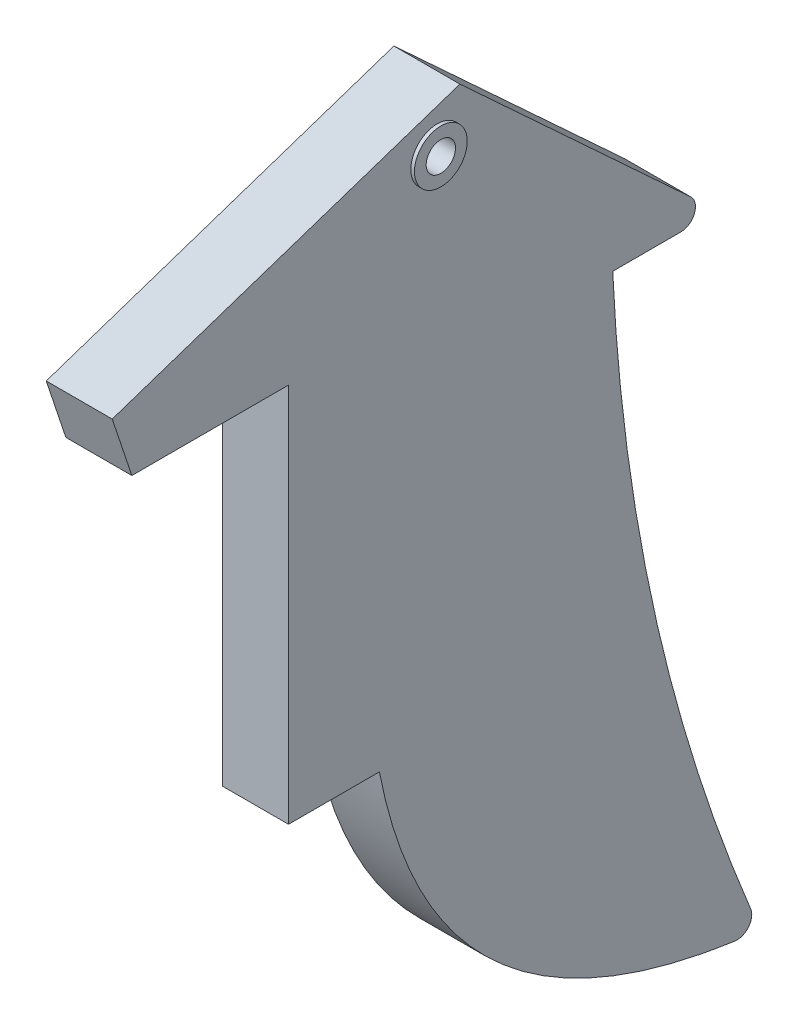
ISO-10303-21;
HEADER;
FILE_DESCRIPTION(('STEP AP214'),'2;1');
FILE_NAME('part.step','',(''),(''),'','','');
FILE_SCHEMA(('AUTOMOTIVE_DESIGN { 1 0 10303 214 1 1 1 1 }'));
ENDSEC;
DATA;
#1=APPLICATION_CONTEXT('core data for automotive mechanical design processes');
#2=APPLICATION_PROTOCOL_DEFINITION('international standard','automotive_design',2000,#1);
#3=PRODUCT_CONTEXT('',#1,'mechanical');
#4=PRODUCT('Part','Part','',(#3));
#5=PRODUCT_RELATED_PRODUCT_CATEGORY('part','',(#4));
#6=PRODUCT_DEFINITION_FORMATION('','',#4);
#7=PRODUCT_DEFINITION_CONTEXT('part definition',#1,'design');
#8=PRODUCT_DEFINITION('design','',#6,#7);
#9=PRODUCT_DEFINITION_SHAPE('','',#8);
#10=(LENGTH_UNIT() NAMED_UNIT(*) SI_UNIT(.MILLI.,.METRE.));
#11=(NAMED_UNIT(*) PLANE_ANGLE_UNIT() SI_UNIT($,.RADIAN.));
#12=(NAMED_UNIT(*) SI_UNIT($,.STERADIAN.) SOLID_ANGLE_UNIT());
#13=UNCERTAINTY_MEASURE_WITH_UNIT(LENGTH_MEASURE(1.E-05),#10,'distance_accuracy_value','');
#14=(GEOMETRIC_REPRESENTATION_CONTEXT(3) GLOBAL_UNCERTAINTY_ASSIGNED_CONTEXT((#13)) GLOBAL_UNIT_ASSIGNED_CONTEXT((#10,
#11,#12)) REPRESENTATION_CONTEXT('',''));
#15=CARTESIAN_POINT('',(0.,0.,0.));
#16=DIRECTION('',(0.,0.,1.));
#17=DIRECTION('',(1.,0.,0.));
#18=AXIS2_PLACEMENT_3D('',#15,#16,#17);
#19=CARTESIAN_POINT('',(4.5,-16.2675550550536,-17.6253256744449));
#20=DIRECTION('',(0.,-0.734844510898224,0.678235611570751));
#21=DIRECTION('',(0.,-0.678235611570751,-0.734844510898224));
#22=AXIS2_PLACEMENT_3D('',#19,#20,#21);
#23=PLANE('',#22);
#24=DIRECTION('',(0.,0.678235611570751,0.734844510898224));
#25=VECTOR('',#24,1.);
#26=CARTESIAN_POINT('',(4.5,-16.2675550550536,-17.6253256744449));
#27=LINE('',#26,#25);
#28=CARTESIAN_POINT('',(4.5,-14.5327105441554,-15.7456824585085));
#29=VERTEX_POINT('',#28);
#30=CARTESIAN_POINT('',(4.5,0.,0.));
#31=VERTEX_POINT('',#30);
#32=EDGE_CURVE('E124',#29,#31,#27,.T.);
#33=ORIENTED_EDGE('',*,*,#32,.F.);
#34=DIRECTION('',(-1.,0.,0.));
#35=VECTOR('',#34,1.);
#36=CARTESIAN_POINT('',(4.5,-14.5327105441554,-15.7456824585085));
#37=LINE('',#36,#35);
#38=CARTESIAN_POINT('',(0.,-14.5327105441554,-15.7456824585085));
#39=VERTEX_POINT('',#38);
#40=EDGE_CURVE('E153',#29,#39,#37,.T.);
#41=ORIENTED_EDGE('',*,*,#40,.T.);
#42=DIRECTION('',(0.,0.678235611570751,0.734844510898224));
#43=VECTOR('',#42,1.);
#44=CARTESIAN_POINT('',(0.,-16.2675550550536,-17.6253256744449));
#45=LINE('',#44,#43);
#46=CARTESIAN_POINT('',(0.,0.,0.));
#47=VERTEX_POINT('',#46);
#48=EDGE_CURVE('E150',#39,#47,#45,.T.);
#49=ORIENTED_EDGE('',*,*,#48,.T.);
#50=DIRECTION('',(-1.,0.,0.));
#51=VECTOR('',#50,1.);
#52=CARTESIAN_POINT('',(4.5,0.,0.));
#53=LINE('',#52,#51);
#54=EDGE_CURVE('E142',#31,#47,#53,.T.);
#55=ORIENTED_EDGE('',*,*,#54,.F.);
#56=EDGE_LOOP('',(#33,#41,#49,#55));
#57=FACE_BOUND('',#56,.T.);
#58=ADVANCED_FACE('F39',(#57),#23,.F.);
#59=CARTESIAN_POINT('',(4.5,0.,0.));
#60=DIRECTION('',(0.,-0.948393289115171,-0.317096466649042));
#61=DIRECTION('',(0.,0.317096466649042,-0.948393289115171));
#62=AXIS2_PLACEMENT_3D('',#59,#60,#61);
#63=PLANE('',#62);
#64=DIRECTION('',(0.,-0.317096466649042,0.948393289115171));
#65=VECTOR('',#64,1.);
#66=CARTESIAN_POINT('',(0.,0.,0.));
#67=LINE('',#66,#65);
#68=CARTESIAN_POINT('',(0.,-7.92741166622604,23.7098322278793));
#69=VERTEX_POINT('',#68);
#70=EDGE_CURVE('E222',#47,#69,#67,.T.);
#71=ORIENTED_EDGE('',*,*,#70,.T.);
#72=DIRECTION('',(-1.,0.,0.));
#73=VECTOR('',#72,1.);
#74=CARTESIAN_POINT('',(4.5,-7.92741166622604,23.7098322278793));
#75=LINE('',#74,#73);
#76=CARTESIAN_POINT('',(4.5,-7.92741166622604,23.7098322278793));
#77=VERTEX_POINT('',#76);
#78=EDGE_CURVE('E144',#77,#69,#75,.T.);
#79=ORIENTED_EDGE('',*,*,#78,.F.);
#80=DIRECTION('',(0.,-0.317096466649042,0.948393289115171));
#81=VECTOR('',#80,1.);
#82=CARTESIAN_POINT('',(4.5,0.,0.));
#83=LINE('',#82,#81);
#84=EDGE_CURVE('E127',#31,#77,#83,.T.);
#85=ORIENTED_EDGE('',*,*,#84,.F.);
#86=ORIENTED_EDGE('',*,*,#54,.T.);
#87=EDGE_LOOP('',(#71,#79,#85,#86));
#88=FACE_BOUND('',#87,.T.);
#89=ADVANCED_FACE('F141',(#88),#63,.F.);
#90=CARTESIAN_POINT('',(4.5,-7.92741166622604,23.7098322278793));
#91=DIRECTION('',(0.,0.317096466649042,-0.948393289115171));
#92=DIRECTION('',(0.,0.948393289115171,0.317096466649042));
#93=AXIS2_PLACEMENT_3D('',#90,#91,#92);
#94=PLANE('',#93);
#95=DIRECTION('',(0.,-0.948393289115171,-0.317096466649042));
#96=VECTOR('',#95,1.);
#97=CARTESIAN_POINT('',(0.,-7.92741166622604,23.7098322278793));
#98=LINE('',#97,#96);
#99=CARTESIAN_POINT('',(0.,-11.9323938104307,22.3707615053263));
#100=VERTEX_POINT('',#99);
#101=EDGE_CURVE('E228',#69,#100,#98,.T.);
#102=ORIENTED_EDGE('',*,*,#101,.T.);
#103=DIRECTION('',(-1.,0.,0.));
#104=VECTOR('',#103,1.);
#105=CARTESIAN_POINT('',(4.5,-11.9323938104307,22.3707615053263));
#106=LINE('',#105,#104);
#107=CARTESIAN_POINT('',(4.5,-11.9323938104307,22.3707615053263));
#108=VERTEX_POINT('',#107);
#109=EDGE_CURVE('E159',#108,#100,#106,.T.);
#110=ORIENTED_EDGE('',*,*,#109,.F.);
#111=DIRECTION('',(0.,-0.948393289115171,-0.317096466649042));
#112=VECTOR('',#111,1.);
#113=CARTESIAN_POINT('',(4.5,-7.92741166622604,23.7098322278793));
#114=LINE('',#113,#112);
#115=EDGE_CURVE('E147',#77,#108,#114,.T.);
#116=ORIENTED_EDGE('',*,*,#115,.F.);
#117=ORIENTED_EDGE('',*,*,#78,.T.);
#118=EDGE_LOOP('',(#102,#110,#116,#117));
#119=FACE_BOUND('',#118,.T.);
#120=ADVANCED_FACE('F206',(#119),#94,.F.);
#121=CARTESIAN_POINT('',(4.5,-11.9323938104307,22.3707615053263));
#122=DIRECTION('',(0.,1.,0.));
#123=DIRECTION('',(0.,0.,1.));
#124=AXIS2_PLACEMENT_3D('',#121,#122,#123);
#125=PLANE('',#124);
#126=DIRECTION('',(0.,0.,-1.));
#127=VECTOR('',#126,1.);
#128=CARTESIAN_POINT('',(0.,-11.9323938104307,22.3707615053263));
#129=LINE('',#128,#127);
#130=CARTESIAN_POINT('',(0.,-11.9323938104307,11.6857718529667));
#131=VERTEX_POINT('',#130);
#132=EDGE_CURVE('E239',#100,#131,#129,.T.);
#133=ORIENTED_EDGE('',*,*,#132,.T.);
#134=DIRECTION('',(-1.,0.,0.));
#135=VECTOR('',#134,1.);
#136=CARTESIAN_POINT('',(4.5,-11.9323938104307,11.6857718529667));
#137=LINE('',#136,#135);
#138=CARTESIAN_POINT('',(4.5,-11.9323938104307,11.6857718529667));
#139=VERTEX_POINT('',#138);
#140=EDGE_CURVE('E278',#139,#131,#137,.T.);
#141=ORIENTED_EDGE('',*,*,#140,.F.);
#142=DIRECTION('',(0.,0.,-1.));
#143=VECTOR('',#142,1.);
#144=CARTESIAN_POINT('',(4.5,-11.9323938104307,22.3707615053263));
#145=LINE('',#144,#143);
#146=EDGE_CURVE('E289',#108,#139,#145,.T.);
#147=ORIENTED_EDGE('',*,*,#146,.F.);
#148=ORIENTED_EDGE('',*,*,#109,.T.);
#149=EDGE_LOOP('',(#133,#141,#147,#148));
#150=FACE_BOUND('',#149,.T.);
#151=ADVANCED_FACE('F287',(#150),#125,.F.);
#152=CARTESIAN_POINT('',(4.5,-11.9323938104307,11.6857718529667));
#153=DIRECTION('',(0.,0.,-1.));
#154=DIRECTION('',(0.,1.,0.));
#155=AXIS2_PLACEMENT_3D('',#152,#153,#154);
#156=PLANE('',#155);
#157=DIRECTION('',(0.,-1.,0.));
#158=VECTOR('',#157,1.);
#159=CARTESIAN_POINT('',(0.,-11.9323938104307,11.6857718529667));
#160=LINE('',#159,#158);
#161=CARTESIAN_POINT('',(0.,-37.8740212324027,11.6857718529667));
#162=VERTEX_POINT('',#161);
#163=EDGE_CURVE('E242',#131,#162,#160,.T.);
#164=ORIENTED_EDGE('',*,*,#163,.T.);
#165=DIRECTION('',(-1.,0.,0.));
#166=VECTOR('',#165,1.);
#167=CARTESIAN_POINT('',(4.5,-37.8740212324027,11.6857718529667));
#168=LINE('',#167,#166);
#169=CARTESIAN_POINT('',(4.5,-37.8740212324027,11.6857718529667));
#170=VERTEX_POINT('',#169);
#171=EDGE_CURVE('E274',#170,#162,#168,.T.);
#172=ORIENTED_EDGE('',*,*,#171,.F.);
#173=DIRECTION('',(0.,-1.,0.));
#174=VECTOR('',#173,1.);
#175=CARTESIAN_POINT('',(4.5,-11.9323938104307,11.6857718529667));
#176=LINE('',#175,#174);
#177=EDGE_CURVE('E304',#139,#170,#176,.T.);
#178=ORIENTED_EDGE('',*,*,#177,.F.);
#179=ORIENTED_EDGE('',*,*,#140,.T.);
#180=EDGE_LOOP('',(#164,#172,#178,#179));
#181=FACE_BOUND('',#180,.T.);
#182=ADVANCED_FACE('F295',(#181),#156,.F.);
#183=CARTESIAN_POINT('',(4.5,-37.8740212324027,11.6857718529667));
#184=DIRECTION('',(0.,1.,0.));
#185=DIRECTION('',(0.,0.,1.));
#186=AXIS2_PLACEMENT_3D('',#183,#184,#185);
#187=PLANE('',#186);
#188=DIRECTION('',(0.,0.,-1.));
#189=VECTOR('',#188,1.);
#190=CARTESIAN_POINT('',(0.,-37.8740212324027,11.6857718529667));
#191=LINE('',#190,#189);
#192=CARTESIAN_POINT('',(0.,-37.8740212324027,5.48856837574249));
#193=VERTEX_POINT('',#192);
#194=EDGE_CURVE('E245',#162,#193,#191,.T.);
#195=ORIENTED_EDGE('',*,*,#194,.T.);
#196=DIRECTION('',(-1.,0.,0.));
#197=VECTOR('',#196,1.);
#198=CARTESIAN_POINT('',(4.5,-37.8740212324027,5.48856837574249));
#199=LINE('',#198,#197);
#200=CARTESIAN_POINT('',(4.5,-37.8740212324027,5.48856837574249));
#201=VERTEX_POINT('',#200);
#202=EDGE_CURVE('E270',#201,#193,#199,.T.);
#203=ORIENTED_EDGE('',*,*,#202,.F.);
#204=DIRECTION('',(0.,0.,-1.));
#205=VECTOR('',#204,1.);
#206=CARTESIAN_POINT('',(4.5,-37.8740212324027,11.6857718529667));
#207=LINE('',#206,#205);
#208=EDGE_CURVE('E301',#170,#201,#207,.T.);
#209=ORIENTED_EDGE('',*,*,#208,.F.);
#210=ORIENTED_EDGE('',*,*,#171,.T.);
#211=EDGE_LOOP('',(#195,#203,#209,#210));
#212=FACE_BOUND('',#211,.T.);
#213=ADVANCED_FACE('F299',(#212),#187,.F.);
#214=CARTESIAN_POINT('',(4.5,-37.8740212324027,5.48856837574249));
#215=CARTESIAN_POINT('',(4.5,-57.8903160761035,1.64322261415932));
#216=CARTESIAN_POINT('',(4.5,-60.1993385356175,-20.4966096148225));
#217=B_SPLINE_CURVE_WITH_KNOTS('',2,(#214,#215,#216),.UNSPECIFIED.,.F.,.F.,(3,3),(0.,1.),.UNSPECIFIED.);
#218=DIRECTION('',(-1.,0.,0.));
#219=VECTOR('',#218,1.);
#220=SURFACE_OF_LINEAR_EXTRUSION('',#217,#219);
#221=CARTESIAN_POINT('',(0.,-37.8740212324027,5.48856837574249));
#222=CARTESIAN_POINT('',(0.,-57.8903160761035,1.64322261415932));
#223=CARTESIAN_POINT('',(0.,-60.1993385356175,-20.4966096148225));
#224=B_SPLINE_CURVE_WITH_KNOTS('',2,(#221,#222,#223),.UNSPECIFIED.,.F.,.F.,(3,3),(0.,1.),.UNSPECIFIED.);
#225=CARTESIAN_POINT('',(0.,-59.9878369841446,-18.7657144543999));
#226=VERTEX_POINT('',#225);
#227=EDGE_CURVE('E248',#193,#226,#224,.T.);
#228=ORIENTED_EDGE('',*,*,#227,.T.);
#229=DIRECTION('',(-1.,0.,0.));
#230=VECTOR('',#229,1.);
#231=CARTESIAN_POINT('',(0.,-59.9878369841446,-18.7657144543999));
#232=LINE('',#231,#230);
#233=CARTESIAN_POINT('',(4.5,-59.9878369841446,-18.7657144543999));
#234=VERTEX_POINT('',#233);
#235=EDGE_CURVE('E55',#226,#234,#232,.F.);
#236=ORIENTED_EDGE('',*,*,#235,.T.);
#237=EDGE_CURVE('E303',#201,#234,#217,.T.);
#238=ORIENTED_EDGE('',*,*,#237,.F.);
#239=ORIENTED_EDGE('',*,*,#202,.T.);
#240=EDGE_LOOP('',(#228,#236,#238,#239));
#241=FACE_BOUND('',#240,.T.);
#242=ADVANCED_FACE('F322',(#241),#220,.F.);
#243=CARTESIAN_POINT('',(4.5,-60.1993385356175,-20.4966096148225));
#244=CARTESIAN_POINT('',(4.5,-39.1969515228556,-11.4809645237938));
#245=CARTESIAN_POINT('',(4.5,-16.2675550550536,-10.4231702819952));
#246=B_SPLINE_CURVE_WITH_KNOTS('',2,(#243,#244,#245),.UNSPECIFIED.,.F.,.F.,(3,3),(0.,1.),.UNSPECIFIED.);
#247=DIRECTION('',(-1.,0.,0.));
#248=VECTOR('',#247,1.);
#249=SURFACE_OF_LINEAR_EXTRUSION('',#246,#248);
#250=CARTESIAN_POINT('',(4.5,-58.6154099664554,-19.8291289112356));
#251=VERTEX_POINT('',#250);
#252=CARTESIAN_POINT('',(4.5,-16.2675550550536,-10.4231702819952));
#253=VERTEX_POINT('',#252);
#254=EDGE_CURVE('E308',#251,#253,#246,.T.);
#255=ORIENTED_EDGE('',*,*,#254,.F.);
#256=DIRECTION('',(-1.,0.,0.));
#257=VECTOR('',#256,1.);
#258=CARTESIAN_POINT('',(4.5,-58.6154099664554,-19.8291289112356));
#259=LINE('',#258,#257);
#260=CARTESIAN_POINT('',(0.,-58.6154099664554,-19.8291289112356));
#261=VERTEX_POINT('',#260);
#262=EDGE_CURVE('E170',#251,#261,#259,.T.);
#263=ORIENTED_EDGE('',*,*,#262,.T.);
#264=CARTESIAN_POINT('',(0.,-60.1993385356175,-20.4966096148225));
#265=CARTESIAN_POINT('',(0.,-39.1969515228556,-11.4809645237938));
#266=CARTESIAN_POINT('',(0.,-16.2675550550536,-10.4231702819952));
#267=B_SPLINE_CURVE_WITH_KNOTS('',2,(#264,#265,#266),.UNSPECIFIED.,.F.,.F.,(3,3),(0.,1.),.UNSPECIFIED.);
#268=CARTESIAN_POINT('',(0.,-16.2675550550536,-10.4231702819952));
#269=VERTEX_POINT('',#268);
#270=EDGE_CURVE('E253',#261,#269,#267,.T.);
#271=ORIENTED_EDGE('',*,*,#270,.T.);
#272=DIRECTION('',(-1.,0.,0.));
#273=VECTOR('',#272,1.);
#274=CARTESIAN_POINT('',(4.5,-16.2675550550536,-10.4231702819952));
#275=LINE('',#274,#273);
#276=EDGE_CURVE('E266',#253,#269,#275,.T.);
#277=ORIENTED_EDGE('',*,*,#276,.F.);
#278=EDGE_LOOP('',(#255,#263,#271,#277));
#279=FACE_BOUND('',#278,.T.);
#280=ADVANCED_FACE('F197',(#279),#249,.F.);
#281=CARTESIAN_POINT('',(4.5,-16.2675550550536,-10.4231702819952));
#282=DIRECTION('',(0.,1.,0.));
#283=DIRECTION('',(0.,0.,1.));
#284=AXIS2_PLACEMENT_3D('',#281,#282,#283);
#285=PLANE('',#284);
#286=DIRECTION('',(0.,0.,-1.));
#287=VECTOR('',#286,1.);
#288=CARTESIAN_POINT('',(0.,-16.2675550550536,-10.4231702819952));
#289=LINE('',#288,#287);
#290=CARTESIAN_POINT('',(0.,-16.2675550550536,-15.0674468469377));
#291=VERTEX_POINT('',#290);
#292=EDGE_CURVE('E137',#269,#291,#289,.T.);
#293=ORIENTED_EDGE('',*,*,#292,.T.);
#294=DIRECTION('',(-1.,0.,0.));
#295=VECTOR('',#294,1.);
#296=CARTESIAN_POINT('',(4.5,-16.2675550550536,-15.0674468469377));
#297=LINE('',#296,#295);
#298=CARTESIAN_POINT('',(4.5,-16.2675550550536,-15.0674468469377));
#299=VERTEX_POINT('',#298);
#300=EDGE_CURVE('E165',#291,#299,#297,.F.);
#301=ORIENTED_EDGE('',*,*,#300,.T.);
#302=DIRECTION('',(0.,0.,-1.));
#303=VECTOR('',#302,1.);
#304=CARTESIAN_POINT('',(4.5,-16.2675550550536,-10.4231702819952));
#305=LINE('',#304,#303);
#306=EDGE_CURVE('E234',#253,#299,#305,.T.);
#307=ORIENTED_EDGE('',*,*,#306,.F.);
#308=ORIENTED_EDGE('',*,*,#276,.T.);
#309=EDGE_LOOP('',(#293,#301,#307,#308));
#310=FACE_BOUND('',#309,.T.);
#311=ADVANCED_FACE('F188',(#310),#285,.F.);
#312=CARTESIAN_POINT('',(4.5,-53.4634979800568,-2.93039900269033));
#313=DIRECTION('',(-1.,0.,0.));
#314=DIRECTION('',(0.,0.,1.));
#315=AXIS2_PLACEMENT_3D('',#312,#313,#314);
#316=PLANE('',#315);
#317=CARTESIAN_POINT('',(4.5,-3.37223552666983,1.54925256068286));
#318=DIRECTION('',(-1.,0.,0.));
#319=DIRECTION('',(0.,0.,1.));
#320=AXIS2_PLACEMENT_3D('',#317,#318,#319);
#321=CIRCLE('',#320,1.8);
#322=CARTESIAN_POINT('',(4.5,-3.37223552666983,3.34925256068286));
#323=VERTEX_POINT('',#322);
#324=EDGE_CURVE('E48',#323,#323,#321,.F.);
#325=ORIENTED_EDGE('',*,*,#324,.F.);
#326=EDGE_LOOP('',(#325));
#327=FACE_BOUND('',#326,.T.);
#328=ORIENTED_EDGE('',*,*,#237,.T.);
#329=CARTESIAN_POINT('',(4.5,-58.9975905269062,-18.9050412426599));
#330=DIRECTION('',(-1.,0.,0.));
#331=DIRECTION('',(0.,0.,1.));
#332=AXIS2_PLACEMENT_3D('',#329,#330,#331);
#333=CIRCLE('',#332,1.);
#334=EDGE_CURVE('E178',#234,#251,#333,.F.);
#335=ORIENTED_EDGE('',*,*,#334,.T.);
#336=ORIENTED_EDGE('',*,*,#254,.T.);
#337=ORIENTED_EDGE('',*,*,#306,.T.);
#338=CARTESIAN_POINT('',(4.5,-15.2675550550536,-15.0674468469377));
#339=DIRECTION('',(-1.,0.,0.));
#340=DIRECTION('',(0.,0.,1.));
#341=AXIS2_PLACEMENT_3D('',#338,#339,#340);
#342=CIRCLE('',#341,1.);
#343=EDGE_CURVE('E131',#299,#29,#342,.F.);
#344=ORIENTED_EDGE('',*,*,#343,.T.);
#345=ORIENTED_EDGE('',*,*,#32,.T.);
#346=ORIENTED_EDGE('',*,*,#84,.T.);
#347=ORIENTED_EDGE('',*,*,#115,.T.);
#348=ORIENTED_EDGE('',*,*,#146,.T.);
#349=ORIENTED_EDGE('',*,*,#177,.T.);
#350=ORIENTED_EDGE('',*,*,#208,.T.);
#351=EDGE_LOOP('',(#328,#335,#336,#337,#344,#345,#346,#347,#348,#349,#350));
#352=FACE_BOUND('',#351,.T.);
#353=ADVANCED_FACE('F126',(#327,#352),#316,.F.);
#354=CARTESIAN_POINT('',(0.,-53.4634979800568,-2.93039900269033));
#355=DIRECTION('',(-1.,0.,0.));
#356=DIRECTION('',(0.,0.,1.));
#357=AXIS2_PLACEMENT_3D('',#354,#355,#356);
#358=PLANE('',#357);
#359=CARTESIAN_POINT('',(0.,-3.37223552666983,1.54925256068286));
#360=DIRECTION('',(-1.,0.,0.));
#361=DIRECTION('',(0.,0.,1.));
#362=AXIS2_PLACEMENT_3D('',#359,#360,#361);
#363=CIRCLE('',#362,1.8);
#364=CARTESIAN_POINT('',(0.,-3.37223552666983,3.34925256068286));
#365=VERTEX_POINT('',#364);
#366=EDGE_CURVE('E11',#365,#365,#363,.T.);
#367=ORIENTED_EDGE('',*,*,#366,.F.);
#368=EDGE_LOOP('',(#367));
#369=FACE_BOUND('',#368,.T.);
#370=ORIENTED_EDGE('',*,*,#270,.F.);
#371=CARTESIAN_POINT('',(0.,-58.9975905269062,-18.9050412426599));
#372=DIRECTION('',(-1.,0.,0.));
#373=DIRECTION('',(0.,0.,1.));
#374=AXIS2_PLACEMENT_3D('',#371,#372,#373);
#375=CIRCLE('',#374,1.);
#376=EDGE_CURVE('E63',#261,#226,#375,.T.);
#377=ORIENTED_EDGE('',*,*,#376,.T.);
#378=ORIENTED_EDGE('',*,*,#227,.F.);
#379=ORIENTED_EDGE('',*,*,#194,.F.);
#380=ORIENTED_EDGE('',*,*,#163,.F.);
#381=ORIENTED_EDGE('',*,*,#132,.F.);
#382=ORIENTED_EDGE('',*,*,#101,.F.);
#383=ORIENTED_EDGE('',*,*,#70,.F.);
#384=ORIENTED_EDGE('',*,*,#48,.F.);
#385=CARTESIAN_POINT('',(0.,-15.2675550550536,-15.0674468469377));
#386=DIRECTION('',(-1.,0.,0.));
#387=DIRECTION('',(0.,0.,1.));
#388=AXIS2_PLACEMENT_3D('',#385,#386,#387);
#389=CIRCLE('',#388,1.);
#390=EDGE_CURVE('E157',#39,#291,#389,.T.);
#391=ORIENTED_EDGE('',*,*,#390,.T.);
#392=ORIENTED_EDGE('',*,*,#292,.F.);
#393=EDGE_LOOP('',(#370,#377,#378,#379,#380,#381,#382,#383,#384,#391,#392));
#394=FACE_BOUND('',#393,.T.);
#395=ADVANCED_FACE('F187',(#369,#394),#358,.T.);
#396=CARTESIAN_POINT('',(0.,-3.37223552666983,1.54925256068286));
#397=DIRECTION('',(1.,0.,0.));
#398=DIRECTION('',(0.,0.,-1.));
#399=AXIS2_PLACEMENT_3D('',#396,#397,#398);
#400=CYLINDRICAL_SURFACE('',#399,1.);
#401=CARTESIAN_POINT('',(4.75,-3.37223552666983,1.54925256068286));
#402=DIRECTION('',(1.,0.,0.));
#403=DIRECTION('',(0.,0.,-1.));
#404=AXIS2_PLACEMENT_3D('',#401,#402,#403);
#405=CIRCLE('',#404,1.);
#406=CARTESIAN_POINT('',(4.75,-3.37223552666983,0.549252560682862));
#407=VERTEX_POINT('',#406);
#408=EDGE_CURVE('E231',#407,#407,#405,.T.);
#409=ORIENTED_EDGE('',*,*,#408,.T.);
#410=EDGE_LOOP('',(#409));
#411=FACE_BOUND('',#410,.T.);
#412=CARTESIAN_POINT('',(-0.25,-3.37223552666983,1.54925256068286));
#413=DIRECTION('',(1.,0.,0.));
#414=DIRECTION('',(0.,0.,-1.));
#415=AXIS2_PLACEMENT_3D('',#412,#413,#414);
#416=CIRCLE('',#415,1.);
#417=CARTESIAN_POINT('',(-0.25,-3.37223552666983,0.549252560682862));
#418=VERTEX_POINT('',#417);
#419=EDGE_CURVE('E345',#418,#418,#416,.T.);
#420=ORIENTED_EDGE('',*,*,#419,.F.);
#421=EDGE_LOOP('',(#420));
#422=FACE_BOUND('',#421,.T.);
#423=ADVANCED_FACE('F194',(#411,#422),#400,.F.);
#424=CARTESIAN_POINT('',(4.5,-15.2675550550536,-15.0674468469377));
#425=DIRECTION('',(-1.,0.,0.));
#426=DIRECTION('',(0.,0.,1.));
#427=AXIS2_PLACEMENT_3D('',#424,#425,#426);
#428=CYLINDRICAL_SURFACE('',#427,1.);
#429=ORIENTED_EDGE('',*,*,#343,.F.);
#430=ORIENTED_EDGE('',*,*,#300,.F.);
#431=ORIENTED_EDGE('',*,*,#390,.F.);
#432=ORIENTED_EDGE('',*,*,#40,.F.);
#433=EDGE_LOOP('',(#429,#430,#431,#432));
#434=FACE_BOUND('',#433,.T.);
#435=ADVANCED_FACE('F209',(#434),#428,.T.);
#436=CARTESIAN_POINT('',(2.25,-58.9975905269062,-18.9050412426599));
#437=DIRECTION('',(-1.,0.,0.));
#438=DIRECTION('',(0.,0.,1.));
#439=AXIS2_PLACEMENT_3D('',#436,#437,#438);
#440=CYLINDRICAL_SURFACE('',#439,1.);
#441=ORIENTED_EDGE('',*,*,#334,.F.);
#442=ORIENTED_EDGE('',*,*,#235,.F.);
#443=ORIENTED_EDGE('',*,*,#376,.F.);
#444=ORIENTED_EDGE('',*,*,#262,.F.);
#445=EDGE_LOOP('',(#441,#442,#443,#444));
#446=FACE_BOUND('',#445,.T.);
#447=ADVANCED_FACE('F41',(#446),#440,.T.);
#448=CARTESIAN_POINT('',(4.75,-3.37223552666983,1.54925256068286));
#449=DIRECTION('',(-1.,0.,0.));
#450=DIRECTION('',(0.,0.,1.));
#451=AXIS2_PLACEMENT_3D('',#448,#449,#450);
#452=CYLINDRICAL_SURFACE('',#451,1.8);
#453=CARTESIAN_POINT('',(4.75,-3.37223552666983,1.54925256068286));
#454=DIRECTION('',(1.,0.,0.));
#455=DIRECTION('',(0.,0.,-1.));
#456=AXIS2_PLACEMENT_3D('',#453,#454,#455);
#457=CIRCLE('',#456,1.8);
#458=CARTESIAN_POINT('',(4.75,-3.37223552666983,-0.250747439317138));
#459=VERTEX_POINT('',#458);
#460=EDGE_CURVE('E224',#459,#459,#457,.T.);
#461=ORIENTED_EDGE('',*,*,#460,.F.);
#462=EDGE_LOOP('',(#461));
#463=FACE_BOUND('',#462,.T.);
#464=ORIENTED_EDGE('',*,*,#324,.T.);
#465=EDGE_LOOP('',(#464));
#466=FACE_BOUND('',#465,.T.);
#467=ADVANCED_FACE('F184',(#463,#466),#452,.T.);
#468=CARTESIAN_POINT('',(4.75,-3.37223552666983,1.54925256068286));
#469=DIRECTION('',(1.,0.,0.));
#470=DIRECTION('',(0.,0.,-1.));
#471=AXIS2_PLACEMENT_3D('',#468,#469,#470);
#472=PLANE('',#471);
#473=ORIENTED_EDGE('',*,*,#408,.F.);
#474=EDGE_LOOP('',(#473));
#475=FACE_BOUND('',#474,.T.);
#476=ORIENTED_EDGE('',*,*,#460,.T.);
#477=EDGE_LOOP('',(#476));
#478=FACE_BOUND('',#477,.T.);
#479=ADVANCED_FACE('F360',(#475,#478),#472,.T.);
#480=CARTESIAN_POINT('',(-0.25,-3.37223552666983,1.54925256068286));
#481=DIRECTION('',(1.,0.,0.));
#482=DIRECTION('',(0.,0.,-1.));
#483=AXIS2_PLACEMENT_3D('',#480,#481,#482);
#484=CYLINDRICAL_SURFACE('',#483,1.8);
#485=CARTESIAN_POINT('',(-0.25,-3.37223552666983,1.54925256068286));
#486=DIRECTION('',(1.,0.,0.));
#487=DIRECTION('',(0.,0.,-1.));
#488=AXIS2_PLACEMENT_3D('',#485,#486,#487);
#489=CIRCLE('',#488,1.8);
#490=CARTESIAN_POINT('',(-0.25,-3.37223552666983,-0.250747439317138));
#491=VERTEX_POINT('',#490);
#492=EDGE_CURVE('E341',#491,#491,#489,.T.);
#493=ORIENTED_EDGE('',*,*,#492,.T.);
#494=EDGE_LOOP('',(#493));
#495=FACE_BOUND('',#494,.T.);
#496=ORIENTED_EDGE('',*,*,#366,.T.);
#497=EDGE_LOOP('',(#496));
#498=FACE_BOUND('',#497,.T.);
#499=ADVANCED_FACE('F354',(#495,#498),#484,.T.);
#500=CARTESIAN_POINT('',(-0.25,-3.37223552666983,1.54925256068286));
#501=DIRECTION('',(-1.,0.,0.));
#502=DIRECTION('',(0.,0.,-1.));
#503=AXIS2_PLACEMENT_3D('',#500,#501,#502);
#504=PLANE('',#503);
#505=ORIENTED_EDGE('',*,*,#419,.T.);
#506=EDGE_LOOP('',(#505));
#507=FACE_BOUND('',#506,.T.);
#508=ORIENTED_EDGE('',*,*,#492,.F.);
#509=EDGE_LOOP('',(#508));
#510=FACE_BOUND('',#509,.T.);
#511=ADVANCED_FACE('F350',(#507,#510),#504,.T.);
#512=CLOSED_SHELL('',(#58,#89,#120,#151,#182,#213,#242,#280,#311,#353,#395,#423,#435,#447,#467,
#479,#499,#511));
#513=MANIFOLD_SOLID_BREP('B2',#512);
#514=ADVANCED_BREP_SHAPE_REPRESENTATION('',(#18,#513),#14);
#515=SHAPE_DEFINITION_REPRESENTATION(#9,#514);
ENDSEC;
END-ISO-10303-21;
